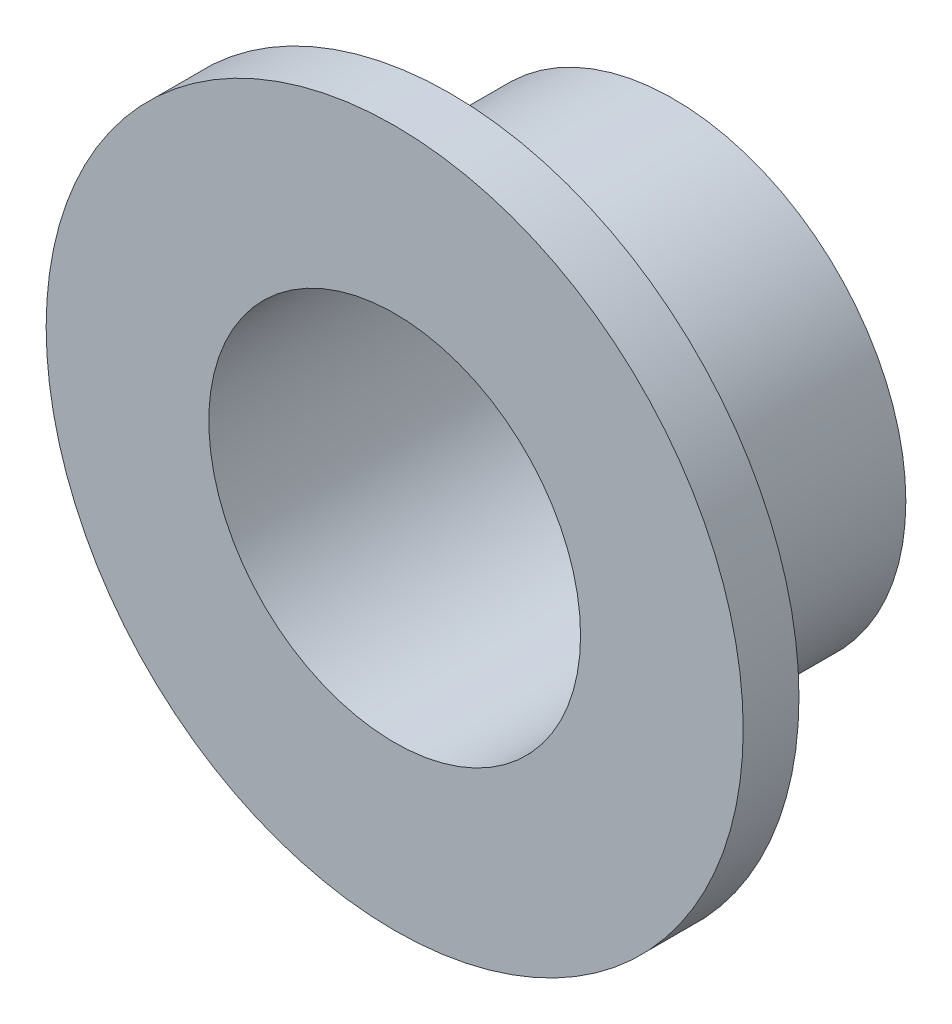
ISO-10303-21;
HEADER;
FILE_DESCRIPTION(('STEP AP214'),'2;1');
FILE_NAME('part.step','',(''),(''),'','','');
FILE_SCHEMA(('AUTOMOTIVE_DESIGN { 1 0 10303 214 1 1 1 1 }'));
ENDSEC;
DATA;
#1=APPLICATION_CONTEXT('core data for automotive mechanical design processes');
#2=APPLICATION_PROTOCOL_DEFINITION('international standard','automotive_design',2000,#1);
#3=PRODUCT_CONTEXT('',#1,'mechanical');
#4=PRODUCT('Part','Part','',(#3));
#5=PRODUCT_RELATED_PRODUCT_CATEGORY('part','',(#4));
#6=PRODUCT_DEFINITION_FORMATION('','',#4);
#7=PRODUCT_DEFINITION_CONTEXT('part definition',#1,'design');
#8=PRODUCT_DEFINITION('design','',#6,#7);
#9=PRODUCT_DEFINITION_SHAPE('','',#8);
#10=(LENGTH_UNIT() NAMED_UNIT(*) SI_UNIT(.MILLI.,.METRE.));
#11=(NAMED_UNIT(*) PLANE_ANGLE_UNIT() SI_UNIT($,.RADIAN.));
#12=(NAMED_UNIT(*) SI_UNIT($,.STERADIAN.) SOLID_ANGLE_UNIT());
#13=UNCERTAINTY_MEASURE_WITH_UNIT(LENGTH_MEASURE(1.E-05),#10,'distance_accuracy_value','');
#14=(GEOMETRIC_REPRESENTATION_CONTEXT(3) GLOBAL_UNCERTAINTY_ASSIGNED_CONTEXT((#13)) GLOBAL_UNIT_ASSIGNED_CONTEXT((#10,
#11,#12)) REPRESENTATION_CONTEXT('',''));
#15=CARTESIAN_POINT('',(0.,0.,0.));
#16=DIRECTION('',(0.,0.,1.));
#17=DIRECTION('',(1.,0.,0.));
#18=AXIS2_PLACEMENT_3D('',#15,#16,#17);
#19=CARTESIAN_POINT('',(0.,0.,0.));
#20=DIRECTION('',(0.,0.,1.));
#21=DIRECTION('',(1.,0.,0.));
#22=AXIS2_PLACEMENT_3D('',#19,#20,#21);
#23=CYLINDRICAL_SURFACE('',#22,4.);
#24=CARTESIAN_POINT('',(0.,0.,-6.));
#25=DIRECTION('',(0.,0.,1.));
#26=DIRECTION('',(1.,0.,0.));
#27=AXIS2_PLACEMENT_3D('',#24,#25,#26);
#28=CIRCLE('',#27,4.);
#29=CARTESIAN_POINT('',(4.,0.,-6.));
#30=VERTEX_POINT('',#29);
#31=EDGE_CURVE('E57',#30,#30,#28,.T.);
#32=ORIENTED_EDGE('',*,*,#31,.F.);
#33=EDGE_LOOP('',(#32));
#34=FACE_BOUND('',#33,.T.);
#35=CARTESIAN_POINT('',(0.,0.,0.));
#36=DIRECTION('',(0.,0.,1.));
#37=DIRECTION('',(1.,0.,0.));
#38=AXIS2_PLACEMENT_3D('',#35,#36,#37);
#39=CIRCLE('',#38,4.);
#40=CARTESIAN_POINT('',(4.,0.,0.));
#41=VERTEX_POINT('',#40);
#42=EDGE_CURVE('E10',#41,#41,#39,.T.);
#43=ORIENTED_EDGE('',*,*,#42,.T.);
#44=EDGE_LOOP('',(#43));
#45=FACE_BOUND('',#44,.T.);
#46=ADVANCED_FACE('F35',(#34,#45),#23,.F.);
#47=CARTESIAN_POINT('',(0.,4.,0.));
#48=DIRECTION('',(0.,0.,-1.));
#49=DIRECTION('',(-1.,0.,0.));
#50=AXIS2_PLACEMENT_3D('',#47,#48,#49);
#51=PLANE('',#50);
#52=ORIENTED_EDGE('',*,*,#42,.F.);
#53=EDGE_LOOP('',(#52));
#54=FACE_BOUND('',#53,.T.);
#55=CARTESIAN_POINT('',(0.,0.,0.));
#56=DIRECTION('',(0.,0.,1.));
#57=DIRECTION('',(1.,0.,0.));
#58=AXIS2_PLACEMENT_3D('',#55,#56,#57);
#59=CIRCLE('',#58,7.5);
#60=CARTESIAN_POINT('',(7.5,0.,0.));
#61=VERTEX_POINT('',#60);
#62=EDGE_CURVE('E41',#61,#61,#59,.T.);
#63=ORIENTED_EDGE('',*,*,#62,.T.);
#64=EDGE_LOOP('',(#63));
#65=FACE_BOUND('',#64,.T.);
#66=ADVANCED_FACE('F64',(#54,#65),#51,.F.);
#67=CARTESIAN_POINT('',(0.,0.,0.));
#68=DIRECTION('',(0.,0.,1.));
#69=DIRECTION('',(1.,0.,0.));
#70=AXIS2_PLACEMENT_3D('',#67,#68,#69);
#71=CYLINDRICAL_SURFACE('',#70,7.5);
#72=ORIENTED_EDGE('',*,*,#62,.F.);
#73=EDGE_LOOP('',(#72));
#74=FACE_BOUND('',#73,.T.);
#75=CARTESIAN_POINT('',(0.,0.,-1.2));
#76=DIRECTION('',(0.,0.,1.));
#77=DIRECTION('',(1.,0.,0.));
#78=AXIS2_PLACEMENT_3D('',#75,#76,#77);
#79=CIRCLE('',#78,7.5);
#80=CARTESIAN_POINT('',(7.5,0.,-1.2));
#81=VERTEX_POINT('',#80);
#82=EDGE_CURVE('E45',#81,#81,#79,.T.);
#83=ORIENTED_EDGE('',*,*,#82,.T.);
#84=EDGE_LOOP('',(#83));
#85=FACE_BOUND('',#84,.T.);
#86=ADVANCED_FACE('F68',(#74,#85),#71,.T.);
#87=CARTESIAN_POINT('',(0.,7.5,-1.2));
#88=DIRECTION('',(0.,0.,1.));
#89=DIRECTION('',(1.,0.,0.));
#90=AXIS2_PLACEMENT_3D('',#87,#88,#89);
#91=PLANE('',#90);
#92=ORIENTED_EDGE('',*,*,#82,.F.);
#93=EDGE_LOOP('',(#92));
#94=FACE_BOUND('',#93,.T.);
#95=CARTESIAN_POINT('',(0.,0.,-1.2));
#96=DIRECTION('',(0.,0.,1.));
#97=DIRECTION('',(1.,0.,0.));
#98=AXIS2_PLACEMENT_3D('',#95,#96,#97);
#99=CIRCLE('',#98,5.);
#100=CARTESIAN_POINT('',(5.,0.,-1.2));
#101=VERTEX_POINT('',#100);
#102=EDGE_CURVE('E49',#101,#101,#99,.T.);
#103=ORIENTED_EDGE('',*,*,#102,.T.);
#104=EDGE_LOOP('',(#103));
#105=FACE_BOUND('',#104,.T.);
#106=ADVANCED_FACE('F73',(#94,#105),#91,.F.);
#107=CARTESIAN_POINT('',(0.,0.,0.));
#108=DIRECTION('',(0.,0.,1.));
#109=DIRECTION('',(1.,0.,0.));
#110=AXIS2_PLACEMENT_3D('',#107,#108,#109);
#111=CYLINDRICAL_SURFACE('',#110,5.);
#112=ORIENTED_EDGE('',*,*,#102,.F.);
#113=EDGE_LOOP('',(#112));
#114=FACE_BOUND('',#113,.T.);
#115=CARTESIAN_POINT('',(0.,0.,-6.));
#116=DIRECTION('',(0.,0.,1.));
#117=DIRECTION('',(1.,0.,0.));
#118=AXIS2_PLACEMENT_3D('',#115,#116,#117);
#119=CIRCLE('',#118,5.);
#120=CARTESIAN_POINT('',(5.,0.,-6.));
#121=VERTEX_POINT('',#120);
#122=EDGE_CURVE('E54',#121,#121,#119,.T.);
#123=ORIENTED_EDGE('',*,*,#122,.T.);
#124=EDGE_LOOP('',(#123));
#125=FACE_BOUND('',#124,.T.);
#126=ADVANCED_FACE('F79',(#114,#125),#111,.T.);
#127=CARTESIAN_POINT('',(0.,5.,-6.));
#128=DIRECTION('',(0.,0.,1.));
#129=DIRECTION('',(1.,0.,0.));
#130=AXIS2_PLACEMENT_3D('',#127,#128,#129);
#131=PLANE('',#130);
#132=ORIENTED_EDGE('',*,*,#122,.F.);
#133=EDGE_LOOP('',(#132));
#134=FACE_BOUND('',#133,.T.);
#135=ORIENTED_EDGE('',*,*,#31,.T.);
#136=EDGE_LOOP('',(#135));
#137=FACE_BOUND('',#136,.T.);
#138=ADVANCED_FACE('F61',(#134,#137),#131,.F.);
#139=CLOSED_SHELL('',(#46,#66,#86,#106,#126,#138));
#140=MANIFOLD_SOLID_BREP('B2',#139);
#141=ADVANCED_BREP_SHAPE_REPRESENTATION('',(#18,#140),#14);
#142=SHAPE_DEFINITION_REPRESENTATION(#9,#141);
ENDSEC;
END-ISO-10303-21;
